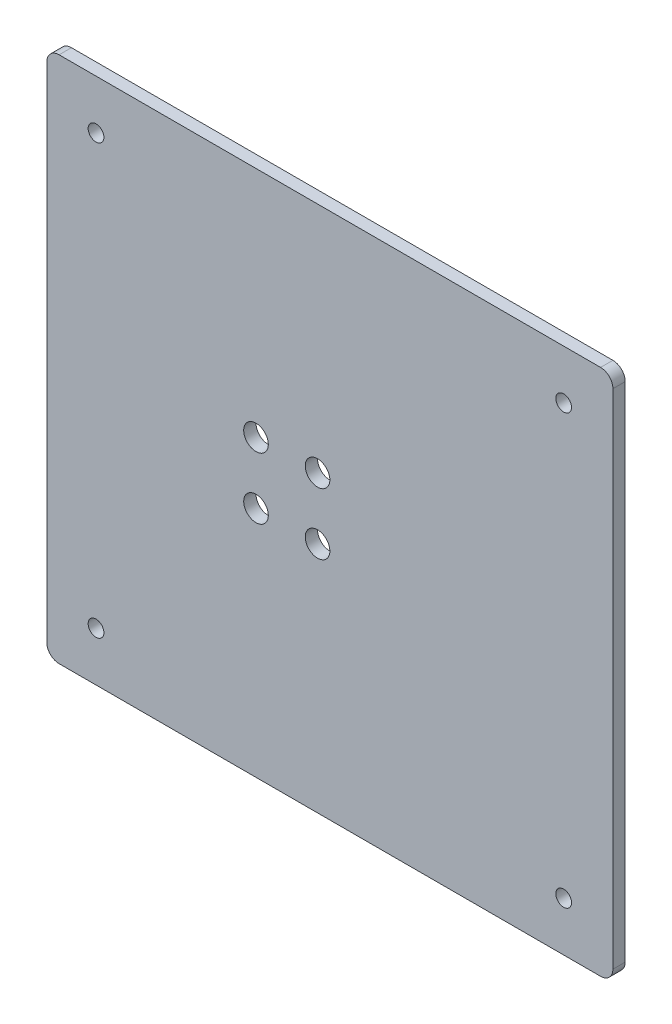
ISO-10303-21;
HEADER;
FILE_DESCRIPTION(('STEP AP214'),'2;1');
FILE_NAME('part.step','',(''),(''),'','','');
FILE_SCHEMA(('AUTOMOTIVE_DESIGN { 1 0 10303 214 1 1 1 1 }'));
ENDSEC;
DATA;
#1=APPLICATION_CONTEXT('core data for automotive mechanical design processes');
#2=APPLICATION_PROTOCOL_DEFINITION('international standard','automotive_design',2000,#1);
#3=PRODUCT_CONTEXT('',#1,'mechanical');
#4=PRODUCT('Part','Part','',(#3));
#5=PRODUCT_RELATED_PRODUCT_CATEGORY('part','',(#4));
#6=PRODUCT_DEFINITION_FORMATION('','',#4);
#7=PRODUCT_DEFINITION_CONTEXT('part definition',#1,'design');
#8=PRODUCT_DEFINITION('design','',#6,#7);
#9=PRODUCT_DEFINITION_SHAPE('','',#8);
#10=(LENGTH_UNIT() NAMED_UNIT(*) SI_UNIT(.MILLI.,.METRE.));
#11=(NAMED_UNIT(*) PLANE_ANGLE_UNIT() SI_UNIT($,.RADIAN.));
#12=(NAMED_UNIT(*) SI_UNIT($,.STERADIAN.) SOLID_ANGLE_UNIT());
#13=UNCERTAINTY_MEASURE_WITH_UNIT(LENGTH_MEASURE(1.E-05),#10,'distance_accuracy_value','');
#14=(GEOMETRIC_REPRESENTATION_CONTEXT(3) GLOBAL_UNCERTAINTY_ASSIGNED_CONTEXT((#13)) GLOBAL_UNIT_ASSIGNED_CONTEXT((#10,
#11,#12)) REPRESENTATION_CONTEXT('',''));
#15=CARTESIAN_POINT('',(0.,0.,0.));
#16=DIRECTION('',(0.,0.,1.));
#17=DIRECTION('',(1.,0.,0.));
#18=AXIS2_PLACEMENT_3D('',#15,#16,#17);
#19=CARTESIAN_POINT('',(0.,0.,0.));
#20=DIRECTION('',(0.,0.,1.));
#21=DIRECTION('',(1.,0.,0.));
#22=AXIS2_PLACEMENT_3D('',#19,#20,#21);
#23=PLANE('',#22);
#24=DIRECTION('',(0.,1.,0.));
#25=VECTOR('',#24,1.);
#26=CARTESIAN_POINT('',(85.,-77.125,0.));
#27=LINE('',#26,#25);
#28=CARTESIAN_POINT('',(85.,-72.125,0.));
#29=VERTEX_POINT('',#28);
#30=CARTESIAN_POINT('',(85.,72.125,0.));
#31=VERTEX_POINT('',#30);
#32=EDGE_CURVE('E327',#29,#31,#27,.T.);
#33=ORIENTED_EDGE('',*,*,#32,.F.);
#34=CARTESIAN_POINT('',(80.,-72.125,0.));
#35=DIRECTION('',(0.,0.,1.));
#36=DIRECTION('',(1.,0.,0.));
#37=AXIS2_PLACEMENT_3D('',#34,#35,#36);
#38=CIRCLE('',#37,5.);
#39=CARTESIAN_POINT('',(80.,-77.125,0.));
#40=VERTEX_POINT('',#39);
#41=EDGE_CURVE('E357',#29,#40,#38,.F.);
#42=ORIENTED_EDGE('',*,*,#41,.T.);
#43=DIRECTION('',(1.,0.,0.));
#44=VECTOR('',#43,1.);
#45=CARTESIAN_POINT('',(85.,-77.125,0.));
#46=LINE('',#45,#44);
#47=CARTESIAN_POINT('',(-80.,-77.125,0.));
#48=VERTEX_POINT('',#47);
#49=EDGE_CURVE('E324',#48,#40,#46,.T.);
#50=ORIENTED_EDGE('',*,*,#49,.F.);
#51=CARTESIAN_POINT('',(-80.,-72.125,0.));
#52=DIRECTION('',(0.,0.,1.));
#53=DIRECTION('',(1.,0.,0.));
#54=AXIS2_PLACEMENT_3D('',#51,#52,#53);
#55=CIRCLE('',#54,5.);
#56=CARTESIAN_POINT('',(-85.,-72.125,0.));
#57=VERTEX_POINT('',#56);
#58=EDGE_CURVE('E355',#48,#57,#55,.F.);
#59=ORIENTED_EDGE('',*,*,#58,.T.);
#60=DIRECTION('',(0.,-1.,0.));
#61=VECTOR('',#60,1.);
#62=CARTESIAN_POINT('',(-85.,-77.125,0.));
#63=LINE('',#62,#61);
#64=CARTESIAN_POINT('',(-85.,72.1249999999999,0.));
#65=VERTEX_POINT('',#64);
#66=EDGE_CURVE('E296',#65,#57,#63,.T.);
#67=ORIENTED_EDGE('',*,*,#66,.F.);
#68=CARTESIAN_POINT('',(-80.,72.125,0.));
#69=DIRECTION('',(0.,0.,1.));
#70=DIRECTION('',(1.,0.,0.));
#71=AXIS2_PLACEMENT_3D('',#68,#69,#70);
#72=CIRCLE('',#71,5.);
#73=CARTESIAN_POINT('',(-80.,77.125,0.));
#74=VERTEX_POINT('',#73);
#75=EDGE_CURVE('E353',#65,#74,#72,.F.);
#76=ORIENTED_EDGE('',*,*,#75,.T.);
#77=DIRECTION('',(-1.,0.,0.));
#78=VECTOR('',#77,1.);
#79=CARTESIAN_POINT('',(85.,77.125,0.));
#80=LINE('',#79,#78);
#81=CARTESIAN_POINT('',(80.,77.125,0.));
#82=VERTEX_POINT('',#81);
#83=EDGE_CURVE('E312',#82,#74,#80,.T.);
#84=ORIENTED_EDGE('',*,*,#83,.F.);
#85=CARTESIAN_POINT('',(80.,72.125,0.));
#86=DIRECTION('',(0.,0.,1.));
#87=DIRECTION('',(1.,0.,0.));
#88=AXIS2_PLACEMENT_3D('',#85,#86,#87);
#89=CIRCLE('',#88,5.);
#90=EDGE_CURVE('E351',#82,#31,#89,.F.);
#91=ORIENTED_EDGE('',*,*,#90,.T.);
#92=EDGE_LOOP('',(#33,#42,#50,#59,#67,#76,#84,#91));
#93=FACE_BOUND('',#92,.T.);
#94=DIRECTION('',(-1.,0.,0.));
#95=VECTOR('',#94,1.);
#96=CARTESIAN_POINT('',(80.,72.125,0.));
#97=LINE('',#96,#95);
#98=CARTESIAN_POINT('',(75.,72.125,0.));
#99=VERTEX_POINT('',#98);
#100=CARTESIAN_POINT('',(-74.9999999999999,72.125,0.));
#101=VERTEX_POINT('',#100);
#102=EDGE_CURVE('E291',#99,#101,#97,.T.);
#103=ORIENTED_EDGE('',*,*,#102,.T.);
#104=CARTESIAN_POINT('',(-74.9999999999999,67.125,0.));
#105=DIRECTION('',(0.,0.,1.));
#106=DIRECTION('',(1.,0.,0.));
#107=AXIS2_PLACEMENT_3D('',#104,#105,#106);
#108=CIRCLE('',#107,5.);
#109=CARTESIAN_POINT('',(-80.,67.1249999999999,0.));
#110=VERTEX_POINT('',#109);
#111=EDGE_CURVE('E386',#101,#110,#108,.T.);
#112=ORIENTED_EDGE('',*,*,#111,.T.);
#113=DIRECTION('',(0.,-1.,0.));
#114=VECTOR('',#113,1.);
#115=CARTESIAN_POINT('',(-80.,-72.125,0.));
#116=LINE('',#115,#114);
#117=CARTESIAN_POINT('',(-80.,-67.125,0.));
#118=VERTEX_POINT('',#117);
#119=EDGE_CURVE('E297',#110,#118,#116,.T.);
#120=ORIENTED_EDGE('',*,*,#119,.T.);
#121=CARTESIAN_POINT('',(-75.,-67.125,0.));
#122=DIRECTION('',(0.,0.,1.));
#123=DIRECTION('',(1.,0.,0.));
#124=AXIS2_PLACEMENT_3D('',#121,#122,#123);
#125=CIRCLE('',#124,5.);
#126=CARTESIAN_POINT('',(-74.9999999999999,-72.125,0.));
#127=VERTEX_POINT('',#126);
#128=EDGE_CURVE('E223',#118,#127,#125,.T.);
#129=ORIENTED_EDGE('',*,*,#128,.T.);
#130=DIRECTION('',(1.,0.,0.));
#131=VECTOR('',#130,1.);
#132=CARTESIAN_POINT('',(80.,-72.125,0.));
#133=LINE('',#132,#131);
#134=CARTESIAN_POINT('',(75.,-72.125,0.));
#135=VERTEX_POINT('',#134);
#136=EDGE_CURVE('E300',#127,#135,#133,.T.);
#137=ORIENTED_EDGE('',*,*,#136,.T.);
#138=CARTESIAN_POINT('',(75.,-67.125,0.));
#139=DIRECTION('',(0.,0.,1.));
#140=DIRECTION('',(1.,0.,0.));
#141=AXIS2_PLACEMENT_3D('',#138,#139,#140);
#142=CIRCLE('',#141,5.);
#143=CARTESIAN_POINT('',(80.,-67.125,0.));
#144=VERTEX_POINT('',#143);
#145=EDGE_CURVE('E204',#135,#144,#142,.T.);
#146=ORIENTED_EDGE('',*,*,#145,.T.);
#147=DIRECTION('',(0.,1.,0.));
#148=VECTOR('',#147,1.);
#149=CARTESIAN_POINT('',(80.,-72.125,0.));
#150=LINE('',#149,#148);
#151=CARTESIAN_POINT('',(80.,67.1249999999999,0.));
#152=VERTEX_POINT('',#151);
#153=EDGE_CURVE('E303',#144,#152,#150,.T.);
#154=ORIENTED_EDGE('',*,*,#153,.T.);
#155=CARTESIAN_POINT('',(75.,67.125,0.));
#156=DIRECTION('',(0.,0.,1.));
#157=DIRECTION('',(1.,0.,0.));
#158=AXIS2_PLACEMENT_3D('',#155,#156,#157);
#159=CIRCLE('',#158,5.);
#160=EDGE_CURVE('E391',#152,#99,#159,.T.);
#161=ORIENTED_EDGE('',*,*,#160,.T.);
#162=EDGE_LOOP('',(#103,#112,#120,#129,#137,#146,#154,#161));
#163=FACE_BOUND('',#162,.T.);
#164=ADVANCED_FACE('F34',(#93,#163),#23,.F.);
#165=CARTESIAN_POINT('',(-85.,-77.125,8.));
#166=DIRECTION('',(1.,0.,0.));
#167=DIRECTION('',(0.,0.,-1.));
#168=AXIS2_PLACEMENT_3D('',#165,#166,#167);
#169=PLANE('',#168);
#170=ORIENTED_EDGE('',*,*,#66,.T.);
#171=DIRECTION('',(0.,0.,-1.));
#172=VECTOR('',#171,1.);
#173=CARTESIAN_POINT('',(-85.,-72.125,8.));
#174=LINE('',#173,#172);
#175=CARTESIAN_POINT('',(-85.,-72.125,8.));
#176=VERTEX_POINT('',#175);
#177=EDGE_CURVE('E379',#57,#176,#174,.F.);
#178=ORIENTED_EDGE('',*,*,#177,.T.);
#179=DIRECTION('',(0.,-1.,0.));
#180=VECTOR('',#179,1.);
#181=CARTESIAN_POINT('',(-85.,-77.125,8.));
#182=LINE('',#181,#180);
#183=CARTESIAN_POINT('',(-85.,72.1249999999999,8.));
#184=VERTEX_POINT('',#183);
#185=EDGE_CURVE('E308',#184,#176,#182,.T.);
#186=ORIENTED_EDGE('',*,*,#185,.F.);
#187=DIRECTION('',(0.,0.,-1.));
#188=VECTOR('',#187,1.);
#189=CARTESIAN_POINT('',(-85.,72.125,8.));
#190=LINE('',#189,#188);
#191=EDGE_CURVE('E376',#184,#65,#190,.T.);
#192=ORIENTED_EDGE('',*,*,#191,.T.);
#193=EDGE_LOOP('',(#170,#178,#186,#192));
#194=FACE_BOUND('',#193,.T.);
#195=ADVANCED_FACE('F427',(#194),#169,.F.);
#196=CARTESIAN_POINT('',(85.,-77.125,8.));
#197=DIRECTION('',(0.,1.,0.));
#198=DIRECTION('',(-1.,0.,0.));
#199=AXIS2_PLACEMENT_3D('',#196,#197,#198);
#200=PLANE('',#199);
#201=ORIENTED_EDGE('',*,*,#49,.T.);
#202=DIRECTION('',(0.,0.,-1.));
#203=VECTOR('',#202,1.);
#204=CARTESIAN_POINT('',(80.,-77.125,8.));
#205=LINE('',#204,#203);
#206=CARTESIAN_POINT('',(80.,-77.125,8.));
#207=VERTEX_POINT('',#206);
#208=EDGE_CURVE('E362',#40,#207,#205,.F.);
#209=ORIENTED_EDGE('',*,*,#208,.T.);
#210=DIRECTION('',(1.,0.,0.));
#211=VECTOR('',#210,1.);
#212=CARTESIAN_POINT('',(85.,-77.125,8.));
#213=LINE('',#212,#211);
#214=CARTESIAN_POINT('',(-80.,-77.125,8.));
#215=VERTEX_POINT('',#214);
#216=EDGE_CURVE('E311',#215,#207,#213,.T.);
#217=ORIENTED_EDGE('',*,*,#216,.F.);
#218=DIRECTION('',(0.,0.,-1.));
#219=VECTOR('',#218,1.);
#220=CARTESIAN_POINT('',(-80.,-77.125,8.));
#221=LINE('',#220,#219);
#222=EDGE_CURVE('E359',#215,#48,#221,.T.);
#223=ORIENTED_EDGE('',*,*,#222,.T.);
#224=EDGE_LOOP('',(#201,#209,#217,#223));
#225=FACE_BOUND('',#224,.T.);
#226=ADVANCED_FACE('F433',(#225),#200,.F.);
#227=CARTESIAN_POINT('',(85.,-77.125,8.));
#228=DIRECTION('',(-1.,0.,0.));
#229=DIRECTION('',(0.,0.,1.));
#230=AXIS2_PLACEMENT_3D('',#227,#228,#229);
#231=PLANE('',#230);
#232=DIRECTION('',(0.,1.,0.));
#233=VECTOR('',#232,1.);
#234=CARTESIAN_POINT('',(85.,-77.125,8.));
#235=LINE('',#234,#233);
#236=CARTESIAN_POINT('',(85.,-72.125,8.));
#237=VERTEX_POINT('',#236);
#238=CARTESIAN_POINT('',(85.,72.125,8.));
#239=VERTEX_POINT('',#238);
#240=EDGE_CURVE('E315',#237,#239,#235,.T.);
#241=ORIENTED_EDGE('',*,*,#240,.F.);
#242=DIRECTION('',(0.,0.,-1.));
#243=VECTOR('',#242,1.);
#244=CARTESIAN_POINT('',(85.,-72.125,8.));
#245=LINE('',#244,#243);
#246=EDGE_CURVE('E348',#237,#29,#245,.T.);
#247=ORIENTED_EDGE('',*,*,#246,.T.);
#248=ORIENTED_EDGE('',*,*,#32,.T.);
#249=DIRECTION('',(0.,0.,-1.));
#250=VECTOR('',#249,1.);
#251=CARTESIAN_POINT('',(85.,72.125,8.));
#252=LINE('',#251,#250);
#253=EDGE_CURVE('E208',#31,#239,#252,.F.);
#254=ORIENTED_EDGE('',*,*,#253,.T.);
#255=EDGE_LOOP('',(#241,#247,#248,#254));
#256=FACE_BOUND('',#255,.T.);
#257=ADVANCED_FACE('F443',(#256),#231,.F.);
#258=CARTESIAN_POINT('',(85.,77.125,8.));
#259=DIRECTION('',(0.,-1.,0.));
#260=DIRECTION('',(0.,0.,-1.));
#261=AXIS2_PLACEMENT_3D('',#258,#259,#260);
#262=PLANE('',#261);
#263=ORIENTED_EDGE('',*,*,#83,.T.);
#264=DIRECTION('',(0.,0.,-1.));
#265=VECTOR('',#264,1.);
#266=CARTESIAN_POINT('',(-80.,77.125,8.));
#267=LINE('',#266,#265);
#268=CARTESIAN_POINT('',(-80.,77.125,8.));
#269=VERTEX_POINT('',#268);
#270=EDGE_CURVE('E384',#74,#269,#267,.F.);
#271=ORIENTED_EDGE('',*,*,#270,.T.);
#272=DIRECTION('',(-1.,0.,0.));
#273=VECTOR('',#272,1.);
#274=CARTESIAN_POINT('',(85.,77.125,8.));
#275=LINE('',#274,#273);
#276=CARTESIAN_POINT('',(80.,77.125,8.));
#277=VERTEX_POINT('',#276);
#278=EDGE_CURVE('E318',#277,#269,#275,.T.);
#279=ORIENTED_EDGE('',*,*,#278,.F.);
#280=DIRECTION('',(0.,0.,-1.));
#281=VECTOR('',#280,1.);
#282=CARTESIAN_POINT('',(80.,77.125,8.));
#283=LINE('',#282,#281);
#284=EDGE_CURVE('E381',#277,#82,#283,.T.);
#285=ORIENTED_EDGE('',*,*,#284,.T.);
#286=EDGE_LOOP('',(#263,#271,#279,#285));
#287=FACE_BOUND('',#286,.T.);
#288=ADVANCED_FACE('F440',(#287),#262,.F.);
#289=CARTESIAN_POINT('',(-80.,-72.125,8.));
#290=DIRECTION('',(1.,0.,0.));
#291=DIRECTION('',(0.,0.,-1.));
#292=AXIS2_PLACEMENT_3D('',#289,#290,#291);
#293=PLANE('',#292);
#294=ORIENTED_EDGE('',*,*,#119,.F.);
#295=DIRECTION('',(0.,0.,-1.));
#296=VECTOR('',#295,1.);
#297=CARTESIAN_POINT('',(-80.,67.125,8.));
#298=LINE('',#297,#296);
#299=CARTESIAN_POINT('',(-80.,67.1249999999999,8.));
#300=VERTEX_POINT('',#299);
#301=EDGE_CURVE('E339',#110,#300,#298,.F.);
#302=ORIENTED_EDGE('',*,*,#301,.T.);
#303=DIRECTION('',(0.,-1.,0.));
#304=VECTOR('',#303,1.);
#305=CARTESIAN_POINT('',(-80.,-72.125,8.));
#306=LINE('',#305,#304);
#307=CARTESIAN_POINT('',(-80.,-67.125,8.));
#308=VERTEX_POINT('',#307);
#309=EDGE_CURVE('E219',#300,#308,#306,.T.);
#310=ORIENTED_EDGE('',*,*,#309,.T.);
#311=DIRECTION('',(0.,0.,-1.));
#312=VECTOR('',#311,1.);
#313=CARTESIAN_POINT('',(-80.,-67.125,0.));
#314=LINE('',#313,#312);
#315=EDGE_CURVE('E336',#308,#118,#314,.T.);
#316=ORIENTED_EDGE('',*,*,#315,.T.);
#317=EDGE_LOOP('',(#294,#302,#310,#316));
#318=FACE_BOUND('',#317,.T.);
#319=ADVANCED_FACE('F410',(#318),#293,.T.);
#320=CARTESIAN_POINT('',(80.,-72.125,8.));
#321=DIRECTION('',(0.,1.,0.));
#322=DIRECTION('',(0.,0.,1.));
#323=AXIS2_PLACEMENT_3D('',#320,#321,#322);
#324=PLANE('',#323);
#325=DIRECTION('',(1.,0.,0.));
#326=VECTOR('',#325,1.);
#327=CARTESIAN_POINT('',(80.,-72.125,8.));
#328=LINE('',#327,#326);
#329=CARTESIAN_POINT('',(-74.9999999999999,-72.125,8.));
#330=VERTEX_POINT('',#329);
#331=CARTESIAN_POINT('',(75.,-72.125,8.));
#332=VERTEX_POINT('',#331);
#333=EDGE_CURVE('E212',#330,#332,#328,.T.);
#334=ORIENTED_EDGE('',*,*,#333,.T.);
#335=DIRECTION('',(0.,0.,-1.));
#336=VECTOR('',#335,1.);
#337=CARTESIAN_POINT('',(75.,-72.125,0.));
#338=LINE('',#337,#336);
#339=EDGE_CURVE('E197',#332,#135,#338,.T.);
#340=ORIENTED_EDGE('',*,*,#339,.T.);
#341=ORIENTED_EDGE('',*,*,#136,.F.);
#342=DIRECTION('',(0.,0.,-1.));
#343=VECTOR('',#342,1.);
#344=CARTESIAN_POINT('',(-75.,-72.125,8.));
#345=LINE('',#344,#343);
#346=EDGE_CURVE('E209',#127,#330,#345,.F.);
#347=ORIENTED_EDGE('',*,*,#346,.T.);
#348=EDGE_LOOP('',(#334,#340,#341,#347));
#349=FACE_BOUND('',#348,.T.);
#350=ADVANCED_FACE('F213',(#349),#324,.T.);
#351=CARTESIAN_POINT('',(80.,-72.125,8.));
#352=DIRECTION('',(-1.,0.,0.));
#353=DIRECTION('',(0.,0.,1.));
#354=AXIS2_PLACEMENT_3D('',#351,#352,#353);
#355=PLANE('',#354);
#356=DIRECTION('',(0.,1.,0.));
#357=VECTOR('',#356,1.);
#358=CARTESIAN_POINT('',(80.,-72.125,8.));
#359=LINE('',#358,#357);
#360=CARTESIAN_POINT('',(80.,-67.125,8.));
#361=VERTEX_POINT('',#360);
#362=CARTESIAN_POINT('',(80.,67.1249999999999,8.));
#363=VERTEX_POINT('',#362);
#364=EDGE_CURVE('E218',#361,#363,#359,.T.);
#365=ORIENTED_EDGE('',*,*,#364,.T.);
#366=DIRECTION('',(0.,0.,-1.));
#367=VECTOR('',#366,1.);
#368=CARTESIAN_POINT('',(80.,67.125,0.));
#369=LINE('',#368,#367);
#370=EDGE_CURVE('E343',#363,#152,#369,.T.);
#371=ORIENTED_EDGE('',*,*,#370,.T.);
#372=ORIENTED_EDGE('',*,*,#153,.F.);
#373=DIRECTION('',(0.,0.,-1.));
#374=VECTOR('',#373,1.);
#375=CARTESIAN_POINT('',(80.,-67.125,8.));
#376=LINE('',#375,#374);
#377=EDGE_CURVE('E341',#144,#361,#376,.F.);
#378=ORIENTED_EDGE('',*,*,#377,.T.);
#379=EDGE_LOOP('',(#365,#371,#372,#378));
#380=FACE_BOUND('',#379,.T.);
#381=ADVANCED_FACE('F400',(#380),#355,.T.);
#382=CARTESIAN_POINT('',(80.,72.125,8.));
#383=DIRECTION('',(0.,-1.,0.));
#384=DIRECTION('',(0.,0.,-1.));
#385=AXIS2_PLACEMENT_3D('',#382,#383,#384);
#386=PLANE('',#385);
#387=DIRECTION('',(-1.,0.,0.));
#388=VECTOR('',#387,1.);
#389=CARTESIAN_POINT('',(80.,72.125,8.));
#390=LINE('',#389,#388);
#391=CARTESIAN_POINT('',(75.,72.125,8.));
#392=VERTEX_POINT('',#391);
#393=CARTESIAN_POINT('',(-74.9999999999999,72.125,8.));
#394=VERTEX_POINT('',#393);
#395=EDGE_CURVE('E294',#392,#394,#390,.T.);
#396=ORIENTED_EDGE('',*,*,#395,.T.);
#397=DIRECTION('',(0.,0.,-1.));
#398=VECTOR('',#397,1.);
#399=CARTESIAN_POINT('',(-74.9999999999999,72.125,0.));
#400=LINE('',#399,#398);
#401=EDGE_CURVE('E333',#394,#101,#400,.T.);
#402=ORIENTED_EDGE('',*,*,#401,.T.);
#403=ORIENTED_EDGE('',*,*,#102,.F.);
#404=DIRECTION('',(0.,0.,-1.));
#405=VECTOR('',#404,1.);
#406=CARTESIAN_POINT('',(75.,72.125,8.));
#407=LINE('',#406,#405);
#408=EDGE_CURVE('E321',#99,#392,#407,.F.);
#409=ORIENTED_EDGE('',*,*,#408,.T.);
#410=EDGE_LOOP('',(#396,#402,#403,#409));
#411=FACE_BOUND('',#410,.T.);
#412=ADVANCED_FACE('F416',(#411),#386,.T.);
#413=CARTESIAN_POINT('',(-74.9999999999999,67.125,8.));
#414=DIRECTION('',(0.,0.,1.));
#415=DIRECTION('',(1.,0.,0.));
#416=AXIS2_PLACEMENT_3D('',#413,#414,#415);
#417=CYLINDRICAL_SURFACE('',#416,5.);
#418=CARTESIAN_POINT('',(-74.9999999999999,67.125,8.));
#419=DIRECTION('',(0.,0.,1.));
#420=DIRECTION('',(1.,0.,0.));
#421=AXIS2_PLACEMENT_3D('',#418,#419,#420);
#422=CIRCLE('',#421,5.);
#423=EDGE_CURVE('E388',#300,#394,#422,.F.);
#424=ORIENTED_EDGE('',*,*,#423,.F.);
#425=ORIENTED_EDGE('',*,*,#301,.F.);
#426=ORIENTED_EDGE('',*,*,#111,.F.);
#427=ORIENTED_EDGE('',*,*,#401,.F.);
#428=EDGE_LOOP('',(#424,#425,#426,#427));
#429=FACE_BOUND('',#428,.T.);
#430=ADVANCED_FACE('F414',(#429),#417,.F.);
#431=CARTESIAN_POINT('',(75.,67.125,8.));
#432=DIRECTION('',(0.,0.,1.));
#433=DIRECTION('',(1.,0.,0.));
#434=AXIS2_PLACEMENT_3D('',#431,#432,#433);
#435=CYLINDRICAL_SURFACE('',#434,5.);
#436=CARTESIAN_POINT('',(75.,67.125,8.));
#437=DIRECTION('',(0.,0.,1.));
#438=DIRECTION('',(1.,0.,0.));
#439=AXIS2_PLACEMENT_3D('',#436,#437,#438);
#440=CIRCLE('',#439,5.);
#441=EDGE_CURVE('E227',#392,#363,#440,.F.);
#442=ORIENTED_EDGE('',*,*,#441,.F.);
#443=ORIENTED_EDGE('',*,*,#408,.F.);
#444=ORIENTED_EDGE('',*,*,#160,.F.);
#445=ORIENTED_EDGE('',*,*,#370,.F.);
#446=EDGE_LOOP('',(#442,#443,#444,#445));
#447=FACE_BOUND('',#446,.T.);
#448=ADVANCED_FACE('F397',(#447),#435,.F.);
#449=CARTESIAN_POINT('',(75.,-67.125,8.));
#450=DIRECTION('',(0.,0.,1.));
#451=DIRECTION('',(1.,0.,0.));
#452=AXIS2_PLACEMENT_3D('',#449,#450,#451);
#453=CYLINDRICAL_SURFACE('',#452,5.);
#454=CARTESIAN_POINT('',(75.,-67.125,8.));
#455=DIRECTION('',(0.,0.,1.));
#456=DIRECTION('',(1.,0.,0.));
#457=AXIS2_PLACEMENT_3D('',#454,#455,#456);
#458=CIRCLE('',#457,5.);
#459=EDGE_CURVE('E202',#361,#332,#458,.F.);
#460=ORIENTED_EDGE('',*,*,#459,.F.);
#461=ORIENTED_EDGE('',*,*,#377,.F.);
#462=ORIENTED_EDGE('',*,*,#145,.F.);
#463=ORIENTED_EDGE('',*,*,#339,.F.);
#464=EDGE_LOOP('',(#460,#461,#462,#463));
#465=FACE_BOUND('',#464,.T.);
#466=ADVANCED_FACE('F199',(#465),#453,.F.);
#467=CARTESIAN_POINT('',(-75.,-67.125,8.));
#468=DIRECTION('',(0.,0.,1.));
#469=DIRECTION('',(1.,0.,0.));
#470=AXIS2_PLACEMENT_3D('',#467,#468,#469);
#471=CYLINDRICAL_SURFACE('',#470,5.);
#472=CARTESIAN_POINT('',(-75.,-67.125,8.));
#473=DIRECTION('',(0.,0.,1.));
#474=DIRECTION('',(1.,0.,0.));
#475=AXIS2_PLACEMENT_3D('',#472,#473,#474);
#476=CIRCLE('',#475,5.);
#477=EDGE_CURVE('E225',#330,#308,#476,.F.);
#478=ORIENTED_EDGE('',*,*,#477,.F.);
#479=ORIENTED_EDGE('',*,*,#346,.F.);
#480=ORIENTED_EDGE('',*,*,#128,.F.);
#481=ORIENTED_EDGE('',*,*,#315,.F.);
#482=EDGE_LOOP('',(#478,#479,#480,#481));
#483=FACE_BOUND('',#482,.T.);
#484=ADVANCED_FACE('F404',(#483),#471,.F.);
#485=CARTESIAN_POINT('',(80.,-72.125,8.));
#486=DIRECTION('',(0.,0.,-1.));
#487=DIRECTION('',(-1.,0.,0.));
#488=AXIS2_PLACEMENT_3D('',#485,#486,#487);
#489=CYLINDRICAL_SURFACE('',#488,5.);
#490=CARTESIAN_POINT('',(80.,-72.125,8.));
#491=DIRECTION('',(0.,0.,1.));
#492=DIRECTION('',(1.,0.,0.));
#493=AXIS2_PLACEMENT_3D('',#490,#491,#492);
#494=CIRCLE('',#493,5.);
#495=EDGE_CURVE('E373',#207,#237,#494,.T.);
#496=ORIENTED_EDGE('',*,*,#495,.F.);
#497=ORIENTED_EDGE('',*,*,#208,.F.);
#498=ORIENTED_EDGE('',*,*,#41,.F.);
#499=ORIENTED_EDGE('',*,*,#246,.F.);
#500=EDGE_LOOP('',(#496,#497,#498,#499));
#501=FACE_BOUND('',#500,.T.);
#502=ADVANCED_FACE('F457',(#501),#489,.T.);
#503=CARTESIAN_POINT('',(-80.,-72.125,8.));
#504=DIRECTION('',(0.,0.,-1.));
#505=DIRECTION('',(-1.,0.,0.));
#506=AXIS2_PLACEMENT_3D('',#503,#504,#505);
#507=CYLINDRICAL_SURFACE('',#506,5.);
#508=CARTESIAN_POINT('',(-80.,-72.125,8.));
#509=DIRECTION('',(0.,0.,1.));
#510=DIRECTION('',(1.,0.,0.));
#511=AXIS2_PLACEMENT_3D('',#508,#509,#510);
#512=CIRCLE('',#511,5.);
#513=EDGE_CURVE('E370',#176,#215,#512,.T.);
#514=ORIENTED_EDGE('',*,*,#513,.F.);
#515=ORIENTED_EDGE('',*,*,#177,.F.);
#516=ORIENTED_EDGE('',*,*,#58,.F.);
#517=ORIENTED_EDGE('',*,*,#222,.F.);
#518=EDGE_LOOP('',(#514,#515,#516,#517));
#519=FACE_BOUND('',#518,.T.);
#520=ADVANCED_FACE('F460',(#519),#507,.T.);
#521=CARTESIAN_POINT('',(-80.,72.125,8.));
#522=DIRECTION('',(0.,0.,-1.));
#523=DIRECTION('',(-1.,0.,0.));
#524=AXIS2_PLACEMENT_3D('',#521,#522,#523);
#525=CYLINDRICAL_SURFACE('',#524,5.);
#526=CARTESIAN_POINT('',(-80.,72.125,8.));
#527=DIRECTION('',(0.,0.,1.));
#528=DIRECTION('',(1.,0.,0.));
#529=AXIS2_PLACEMENT_3D('',#526,#527,#528);
#530=CIRCLE('',#529,5.);
#531=EDGE_CURVE('E367',#269,#184,#530,.T.);
#532=ORIENTED_EDGE('',*,*,#531,.F.);
#533=ORIENTED_EDGE('',*,*,#270,.F.);
#534=ORIENTED_EDGE('',*,*,#75,.F.);
#535=ORIENTED_EDGE('',*,*,#191,.F.);
#536=EDGE_LOOP('',(#532,#533,#534,#535));
#537=FACE_BOUND('',#536,.T.);
#538=ADVANCED_FACE('F464',(#537),#525,.T.);
#539=CARTESIAN_POINT('',(80.,72.125,8.));
#540=DIRECTION('',(0.,0.,-1.));
#541=DIRECTION('',(-1.,0.,0.));
#542=AXIS2_PLACEMENT_3D('',#539,#540,#541);
#543=CYLINDRICAL_SURFACE('',#542,5.);
#544=CARTESIAN_POINT('',(80.,72.125,8.));
#545=DIRECTION('',(0.,0.,1.));
#546=DIRECTION('',(1.,0.,0.));
#547=AXIS2_PLACEMENT_3D('',#544,#545,#546);
#548=CIRCLE('',#547,5.);
#549=EDGE_CURVE('E364',#239,#277,#548,.T.);
#550=ORIENTED_EDGE('',*,*,#549,.F.);
#551=ORIENTED_EDGE('',*,*,#253,.F.);
#552=ORIENTED_EDGE('',*,*,#90,.F.);
#553=ORIENTED_EDGE('',*,*,#284,.F.);
#554=EDGE_LOOP('',(#550,#551,#552,#553));
#555=FACE_BOUND('',#554,.T.);
#556=ADVANCED_FACE('F468',(#555),#543,.T.);
#557=CARTESIAN_POINT('',(0.,0.,8.));
#558=DIRECTION('',(0.,0.,1.));
#559=DIRECTION('',(1.,0.,0.));
#560=AXIS2_PLACEMENT_3D('',#557,#558,#559);
#561=PLANE('',#560);
#562=CARTESIAN_POINT('',(-30.,12.5,8.));
#563=DIRECTION('',(0.,0.,1.));
#564=DIRECTION('',(1.,0.,0.));
#565=AXIS2_PLACEMENT_3D('',#562,#563,#564);
#566=CIRCLE('',#565,5.);
#567=CARTESIAN_POINT('',(-25.,12.5,8.));
#568=VERTEX_POINT('',#567);
#569=EDGE_CURVE('E543',#568,#568,#566,.T.);
#570=ORIENTED_EDGE('',*,*,#569,.T.);
#571=EDGE_LOOP('',(#570));
#572=FACE_BOUND('',#571,.T.);
#573=CARTESIAN_POINT('',(-4.99999999999999,12.5,8.));
#574=DIRECTION('',(0.,0.,1.));
#575=DIRECTION('',(1.,0.,0.));
#576=AXIS2_PLACEMENT_3D('',#573,#574,#575);
#577=CIRCLE('',#576,5.);
#578=CARTESIAN_POINT('',(0.,12.5,8.));
#579=VERTEX_POINT('',#578);
#580=EDGE_CURVE('E38',#579,#579,#577,.T.);
#581=ORIENTED_EDGE('',*,*,#580,.T.);
#582=EDGE_LOOP('',(#581));
#583=FACE_BOUND('',#582,.T.);
#584=CARTESIAN_POINT('',(-4.99999999999999,-12.5,8.));
#585=DIRECTION('',(0.,0.,1.));
#586=DIRECTION('',(1.,0.,0.));
#587=AXIS2_PLACEMENT_3D('',#584,#585,#586);
#588=CIRCLE('',#587,5.);
#589=CARTESIAN_POINT('',(0.,-12.5,8.));
#590=VERTEX_POINT('',#589);
#591=EDGE_CURVE('E534',#590,#590,#588,.T.);
#592=ORIENTED_EDGE('',*,*,#591,.T.);
#593=EDGE_LOOP('',(#592));
#594=FACE_BOUND('',#593,.T.);
#595=CARTESIAN_POINT('',(-30.,-12.5,8.));
#596=DIRECTION('',(0.,0.,1.));
#597=DIRECTION('',(1.,0.,0.));
#598=AXIS2_PLACEMENT_3D('',#595,#596,#597);
#599=CIRCLE('',#598,5.);
#600=CARTESIAN_POINT('',(-25.,-12.5,8.));
#601=VERTEX_POINT('',#600);
#602=EDGE_CURVE('E528',#601,#601,#599,.T.);
#603=ORIENTED_EDGE('',*,*,#602,.T.);
#604=EDGE_LOOP('',(#603));
#605=FACE_BOUND('',#604,.T.);
#606=ORIENTED_EDGE('',*,*,#333,.F.);
#607=ORIENTED_EDGE('',*,*,#477,.T.);
#608=ORIENTED_EDGE('',*,*,#309,.F.);
#609=ORIENTED_EDGE('',*,*,#423,.T.);
#610=ORIENTED_EDGE('',*,*,#395,.F.);
#611=ORIENTED_EDGE('',*,*,#441,.T.);
#612=ORIENTED_EDGE('',*,*,#364,.F.);
#613=ORIENTED_EDGE('',*,*,#459,.T.);
#614=EDGE_LOOP('',(#606,#607,#608,#609,#610,#611,#612,#613));
#615=FACE_BOUND('',#614,.T.);
#616=ADVANCED_FACE('F221',(#572,#583,#594,#605,#615),#561,.F.);
#617=CARTESIAN_POINT('',(-94.9999999999999,87.125,8.));
#618=DIRECTION('',(0.,0.,1.));
#619=DIRECTION('',(1.,0.,0.));
#620=AXIS2_PLACEMENT_3D('',#617,#618,#619);
#621=CIRCLE('',#620,3.19999999999999);
#622=CARTESIAN_POINT('',(-91.8,87.125,8.));
#623=VERTEX_POINT('',#622);
#624=EDGE_CURVE('E522',#623,#623,#621,.T.);
#625=ORIENTED_EDGE('',*,*,#624,.T.);
#626=EDGE_LOOP('',(#625));
#627=FACE_BOUND('',#626,.T.);
#628=CARTESIAN_POINT('',(95.,87.125,8.));
#629=DIRECTION('',(0.,0.,1.));
#630=DIRECTION('',(1.,0.,0.));
#631=AXIS2_PLACEMENT_3D('',#628,#629,#630);
#632=CIRCLE('',#631,3.19999999999999);
#633=CARTESIAN_POINT('',(98.2,87.125,8.));
#634=VERTEX_POINT('',#633);
#635=EDGE_CURVE('E516',#634,#634,#632,.T.);
#636=ORIENTED_EDGE('',*,*,#635,.T.);
#637=EDGE_LOOP('',(#636));
#638=FACE_BOUND('',#637,.T.);
#639=CARTESIAN_POINT('',(95.,-87.125,8.));
#640=DIRECTION('',(0.,0.,1.));
#641=DIRECTION('',(1.,0.,0.));
#642=AXIS2_PLACEMENT_3D('',#639,#640,#641);
#643=CIRCLE('',#642,3.19999999999999);
#644=CARTESIAN_POINT('',(98.2,-87.125,8.));
#645=VERTEX_POINT('',#644);
#646=EDGE_CURVE('E510',#645,#645,#643,.T.);
#647=ORIENTED_EDGE('',*,*,#646,.T.);
#648=EDGE_LOOP('',(#647));
#649=FACE_BOUND('',#648,.T.);
#650=CARTESIAN_POINT('',(-95.,-87.125,8.));
#651=DIRECTION('',(0.,0.,1.));
#652=DIRECTION('',(1.,0.,0.));
#653=AXIS2_PLACEMENT_3D('',#650,#651,#652);
#654=CIRCLE('',#653,3.19999999999999);
#655=CARTESIAN_POINT('',(-91.8,-87.125,8.));
#656=VERTEX_POINT('',#655);
#657=EDGE_CURVE('E284',#656,#656,#654,.T.);
#658=ORIENTED_EDGE('',*,*,#657,.T.);
#659=EDGE_LOOP('',(#658));
#660=FACE_BOUND('',#659,.T.);
#661=DIRECTION('',(0.,-1.,0.));
#662=VECTOR('',#661,1.);
#663=CARTESIAN_POINT('',(-115.,-107.125,8.));
#664=LINE('',#663,#662);
#665=CARTESIAN_POINT('',(-115.,102.125,8.));
#666=VERTEX_POINT('',#665);
#667=CARTESIAN_POINT('',(-115.,-102.125,8.));
#668=VERTEX_POINT('',#667);
#669=EDGE_CURVE('E280',#666,#668,#664,.T.);
#670=ORIENTED_EDGE('',*,*,#669,.F.);
#671=CARTESIAN_POINT('',(-110.,102.125,8.));
#672=DIRECTION('',(0.,0.,1.));
#673=DIRECTION('',(1.,0.,0.));
#674=AXIS2_PLACEMENT_3D('',#671,#672,#673);
#675=CIRCLE('',#674,5.);
#676=CARTESIAN_POINT('',(-110.,107.125,8.));
#677=VERTEX_POINT('',#676);
#678=EDGE_CURVE('E243',#666,#677,#675,.F.);
#679=ORIENTED_EDGE('',*,*,#678,.T.);
#680=DIRECTION('',(-1.,0.,0.));
#681=VECTOR('',#680,1.);
#682=CARTESIAN_POINT('',(115.,107.125,8.));
#683=LINE('',#682,#681);
#684=CARTESIAN_POINT('',(110.,107.125,8.));
#685=VERTEX_POINT('',#684);
#686=EDGE_CURVE('E282',#685,#677,#683,.T.);
#687=ORIENTED_EDGE('',*,*,#686,.F.);
#688=CARTESIAN_POINT('',(110.,102.125,8.));
#689=DIRECTION('',(0.,0.,1.));
#690=DIRECTION('',(1.,0.,0.));
#691=AXIS2_PLACEMENT_3D('',#688,#689,#690);
#692=CIRCLE('',#691,5.);
#693=CARTESIAN_POINT('',(115.,102.125,8.));
#694=VERTEX_POINT('',#693);
#695=EDGE_CURVE('E241',#685,#694,#692,.F.);
#696=ORIENTED_EDGE('',*,*,#695,.T.);
#697=DIRECTION('',(0.,1.,0.));
#698=VECTOR('',#697,1.);
#699=CARTESIAN_POINT('',(115.,-107.125,8.));
#700=LINE('',#699,#698);
#701=CARTESIAN_POINT('',(115.,-102.125,8.));
#702=VERTEX_POINT('',#701);
#703=EDGE_CURVE('E279',#702,#694,#700,.T.);
#704=ORIENTED_EDGE('',*,*,#703,.F.);
#705=CARTESIAN_POINT('',(110.,-102.125,8.));
#706=DIRECTION('',(0.,0.,1.));
#707=DIRECTION('',(1.,0.,0.));
#708=AXIS2_PLACEMENT_3D('',#705,#706,#707);
#709=CIRCLE('',#708,5.);
#710=CARTESIAN_POINT('',(110.,-107.125,8.));
#711=VERTEX_POINT('',#710);
#712=EDGE_CURVE('E239',#702,#711,#709,.F.);
#713=ORIENTED_EDGE('',*,*,#712,.T.);
#714=DIRECTION('',(1.,0.,0.));
#715=VECTOR('',#714,1.);
#716=CARTESIAN_POINT('',(115.,-107.125,8.));
#717=LINE('',#716,#715);
#718=CARTESIAN_POINT('',(-110.,-107.125,8.));
#719=VERTEX_POINT('',#718);
#720=EDGE_CURVE('E268',#719,#711,#717,.T.);
#721=ORIENTED_EDGE('',*,*,#720,.F.);
#722=CARTESIAN_POINT('',(-110.,-102.125,8.));
#723=DIRECTION('',(0.,0.,1.));
#724=DIRECTION('',(1.,0.,0.));
#725=AXIS2_PLACEMENT_3D('',#722,#723,#724);
#726=CIRCLE('',#725,5.);
#727=EDGE_CURVE('E237',#719,#668,#726,.F.);
#728=ORIENTED_EDGE('',*,*,#727,.T.);
#729=EDGE_LOOP('',(#670,#679,#687,#696,#704,#713,#721,#728));
#730=FACE_BOUND('',#729,.T.);
#731=ORIENTED_EDGE('',*,*,#513,.T.);
#732=ORIENTED_EDGE('',*,*,#216,.T.);
#733=ORIENTED_EDGE('',*,*,#495,.T.);
#734=ORIENTED_EDGE('',*,*,#240,.T.);
#735=ORIENTED_EDGE('',*,*,#549,.T.);
#736=ORIENTED_EDGE('',*,*,#278,.T.);
#737=ORIENTED_EDGE('',*,*,#531,.T.);
#738=ORIENTED_EDGE('',*,*,#185,.T.);
#739=EDGE_LOOP('',(#731,#732,#733,#734,#735,#736,#737,#738));
#740=FACE_BOUND('',#739,.T.);
#741=ADVANCED_FACE('F275',(#627,#638,#649,#660,#730,#740),#561,.F.);
#742=CARTESIAN_POINT('',(-115.,-107.125,13.));
#743=DIRECTION('',(1.,0.,0.));
#744=DIRECTION('',(0.,0.,-1.));
#745=AXIS2_PLACEMENT_3D('',#742,#743,#744);
#746=PLANE('',#745);
#747=DIRECTION('',(0.,-1.,0.));
#748=VECTOR('',#747,1.);
#749=CARTESIAN_POINT('',(-115.,-107.125,13.));
#750=LINE('',#749,#748);
#751=CARTESIAN_POINT('',(-115.,102.125,13.));
#752=VERTEX_POINT('',#751);
#753=CARTESIAN_POINT('',(-115.,-102.125,13.));
#754=VERTEX_POINT('',#753);
#755=EDGE_CURVE('E290',#752,#754,#750,.T.);
#756=ORIENTED_EDGE('',*,*,#755,.F.);
#757=DIRECTION('',(0.,0.,-1.));
#758=VECTOR('',#757,1.);
#759=CARTESIAN_POINT('',(-115.,102.125,13.));
#760=LINE('',#759,#758);
#761=EDGE_CURVE('E234',#752,#666,#760,.T.);
#762=ORIENTED_EDGE('',*,*,#761,.T.);
#763=ORIENTED_EDGE('',*,*,#669,.T.);
#764=DIRECTION('',(0.,0.,-1.));
#765=VECTOR('',#764,1.);
#766=CARTESIAN_POINT('',(-115.,-102.125,13.));
#767=LINE('',#766,#765);
#768=EDGE_CURVE('E232',#668,#754,#767,.F.);
#769=ORIENTED_EDGE('',*,*,#768,.T.);
#770=EDGE_LOOP('',(#756,#762,#763,#769));
#771=FACE_BOUND('',#770,.T.);
#772=ADVANCED_FACE('F591',(#771),#746,.F.);
#773=CARTESIAN_POINT('',(115.,-107.125,13.));
#774=DIRECTION('',(0.,1.,0.));
#775=DIRECTION('',(-1.,0.,0.));
#776=AXIS2_PLACEMENT_3D('',#773,#774,#775);
#777=PLANE('',#776);
#778=ORIENTED_EDGE('',*,*,#720,.T.);
#779=DIRECTION('',(0.,0.,-1.));
#780=VECTOR('',#779,1.);
#781=CARTESIAN_POINT('',(110.,-107.125,13.));
#782=LINE('',#781,#780);
#783=CARTESIAN_POINT('',(110.,-107.125,13.));
#784=VERTEX_POINT('',#783);
#785=EDGE_CURVE('E11',#711,#784,#782,.F.);
#786=ORIENTED_EDGE('',*,*,#785,.T.);
#787=DIRECTION('',(1.,0.,0.));
#788=VECTOR('',#787,1.);
#789=CARTESIAN_POINT('',(115.,-107.125,13.));
#790=LINE('',#789,#788);
#791=CARTESIAN_POINT('',(-110.,-107.125,13.));
#792=VERTEX_POINT('',#791);
#793=EDGE_CURVE('E270',#792,#784,#790,.T.);
#794=ORIENTED_EDGE('',*,*,#793,.F.);
#795=DIRECTION('',(0.,0.,-1.));
#796=VECTOR('',#795,1.);
#797=CARTESIAN_POINT('',(-110.,-107.125,13.));
#798=LINE('',#797,#796);
#799=EDGE_CURVE('E43',#792,#719,#798,.T.);
#800=ORIENTED_EDGE('',*,*,#799,.T.);
#801=EDGE_LOOP('',(#778,#786,#794,#800));
#802=FACE_BOUND('',#801,.T.);
#803=ADVANCED_FACE('F267',(#802),#777,.F.);
#804=CARTESIAN_POINT('',(115.,-107.125,13.));
#805=DIRECTION('',(-1.,0.,0.));
#806=DIRECTION('',(0.,-1.,0.));
#807=AXIS2_PLACEMENT_3D('',#804,#805,#806);
#808=PLANE('',#807);
#809=ORIENTED_EDGE('',*,*,#703,.T.);
#810=DIRECTION('',(0.,0.,-1.));
#811=VECTOR('',#810,1.);
#812=CARTESIAN_POINT('',(115.,102.125,13.));
#813=LINE('',#812,#811);
#814=CARTESIAN_POINT('',(115.,102.125,13.));
#815=VERTEX_POINT('',#814);
#816=EDGE_CURVE('E50',#694,#815,#813,.F.);
#817=ORIENTED_EDGE('',*,*,#816,.T.);
#818=DIRECTION('',(0.,1.,0.));
#819=VECTOR('',#818,1.);
#820=CARTESIAN_POINT('',(115.,-107.125,13.));
#821=LINE('',#820,#819);
#822=CARTESIAN_POINT('',(115.,-102.125,13.));
#823=VERTEX_POINT('',#822);
#824=EDGE_CURVE('E490',#823,#815,#821,.T.);
#825=ORIENTED_EDGE('',*,*,#824,.F.);
#826=DIRECTION('',(0.,0.,-1.));
#827=VECTOR('',#826,1.);
#828=CARTESIAN_POINT('',(115.,-102.125,13.));
#829=LINE('',#828,#827);
#830=EDGE_CURVE('E257',#823,#702,#829,.T.);
#831=ORIENTED_EDGE('',*,*,#830,.T.);
#832=EDGE_LOOP('',(#809,#817,#825,#831));
#833=FACE_BOUND('',#832,.T.);
#834=ADVANCED_FACE('F489',(#833),#808,.F.);
#835=CARTESIAN_POINT('',(115.,107.125,13.));
#836=DIRECTION('',(0.,-1.,0.));
#837=DIRECTION('',(1.,0.,0.));
#838=AXIS2_PLACEMENT_3D('',#835,#836,#837);
#839=PLANE('',#838);
#840=ORIENTED_EDGE('',*,*,#686,.T.);
#841=DIRECTION('',(0.,0.,-1.));
#842=VECTOR('',#841,1.);
#843=CARTESIAN_POINT('',(-110.,107.125,13.));
#844=LINE('',#843,#842);
#845=CARTESIAN_POINT('',(-110.,107.125,13.));
#846=VERTEX_POINT('',#845);
#847=EDGE_CURVE('E248',#677,#846,#844,.F.);
#848=ORIENTED_EDGE('',*,*,#847,.T.);
#849=DIRECTION('',(-1.,0.,0.));
#850=VECTOR('',#849,1.);
#851=CARTESIAN_POINT('',(115.,107.125,13.));
#852=LINE('',#851,#850);
#853=CARTESIAN_POINT('',(110.,107.125,13.));
#854=VERTEX_POINT('',#853);
#855=EDGE_CURVE('E301',#854,#846,#852,.T.);
#856=ORIENTED_EDGE('',*,*,#855,.F.);
#857=DIRECTION('',(0.,0.,-1.));
#858=VECTOR('',#857,1.);
#859=CARTESIAN_POINT('',(110.,107.125,13.));
#860=LINE('',#859,#858);
#861=EDGE_CURVE('E245',#854,#685,#860,.T.);
#862=ORIENTED_EDGE('',*,*,#861,.T.);
#863=EDGE_LOOP('',(#840,#848,#856,#862));
#864=FACE_BOUND('',#863,.T.);
#865=ADVANCED_FACE('F496',(#864),#839,.F.);
#866=CARTESIAN_POINT('',(0.,0.,13.));
#867=DIRECTION('',(0.,0.,1.));
#868=DIRECTION('',(1.,0.,0.));
#869=AXIS2_PLACEMENT_3D('',#866,#867,#868);
#870=PLANE('',#869);
#871=CARTESIAN_POINT('',(-30.,12.5,13.));
#872=DIRECTION('',(0.,0.,1.));
#873=DIRECTION('',(1.,0.,0.));
#874=AXIS2_PLACEMENT_3D('',#871,#872,#873);
#875=CIRCLE('',#874,5.);
#876=CARTESIAN_POINT('',(-25.,12.5,13.));
#877=VERTEX_POINT('',#876);
#878=EDGE_CURVE('E546',#877,#877,#875,.T.);
#879=ORIENTED_EDGE('',*,*,#878,.F.);
#880=EDGE_LOOP('',(#879));
#881=FACE_BOUND('',#880,.T.);
#882=CARTESIAN_POINT('',(-4.99999999999999,12.5,13.));
#883=DIRECTION('',(0.,0.,1.));
#884=DIRECTION('',(1.,0.,0.));
#885=AXIS2_PLACEMENT_3D('',#882,#883,#884);
#886=CIRCLE('',#885,5.);
#887=CARTESIAN_POINT('',(0.,12.5,13.));
#888=VERTEX_POINT('',#887);
#889=EDGE_CURVE('E540',#888,#888,#886,.T.);
#890=ORIENTED_EDGE('',*,*,#889,.F.);
#891=EDGE_LOOP('',(#890));
#892=FACE_BOUND('',#891,.T.);
#893=CARTESIAN_POINT('',(-4.99999999999999,-12.5,13.));
#894=DIRECTION('',(0.,0.,1.));
#895=DIRECTION('',(1.,0.,0.));
#896=AXIS2_PLACEMENT_3D('',#893,#894,#895);
#897=CIRCLE('',#896,5.);
#898=CARTESIAN_POINT('',(0.,-12.5,13.));
#899=VERTEX_POINT('',#898);
#900=EDGE_CURVE('E537',#899,#899,#897,.T.);
#901=ORIENTED_EDGE('',*,*,#900,.F.);
#902=EDGE_LOOP('',(#901));
#903=FACE_BOUND('',#902,.T.);
#904=CARTESIAN_POINT('',(-30.,-12.5,13.));
#905=DIRECTION('',(0.,0.,1.));
#906=DIRECTION('',(1.,0.,0.));
#907=AXIS2_PLACEMENT_3D('',#904,#905,#906);
#908=CIRCLE('',#907,5.);
#909=CARTESIAN_POINT('',(-25.,-12.5,13.));
#910=VERTEX_POINT('',#909);
#911=EDGE_CURVE('E531',#910,#910,#908,.T.);
#912=ORIENTED_EDGE('',*,*,#911,.F.);
#913=EDGE_LOOP('',(#912));
#914=FACE_BOUND('',#913,.T.);
#915=CARTESIAN_POINT('',(-94.9999999999999,87.125,13.));
#916=DIRECTION('',(0.,0.,1.));
#917=DIRECTION('',(1.,0.,0.));
#918=AXIS2_PLACEMENT_3D('',#915,#916,#917);
#919=CIRCLE('',#918,3.19999999999999);
#920=CARTESIAN_POINT('',(-91.8,87.125,13.));
#921=VERTEX_POINT('',#920);
#922=EDGE_CURVE('E525',#921,#921,#919,.T.);
#923=ORIENTED_EDGE('',*,*,#922,.F.);
#924=EDGE_LOOP('',(#923));
#925=FACE_BOUND('',#924,.T.);
#926=CARTESIAN_POINT('',(95.,87.125,13.));
#927=DIRECTION('',(0.,0.,1.));
#928=DIRECTION('',(1.,0.,0.));
#929=AXIS2_PLACEMENT_3D('',#926,#927,#928);
#930=CIRCLE('',#929,3.19999999999999);
#931=CARTESIAN_POINT('',(98.2,87.125,13.));
#932=VERTEX_POINT('',#931);
#933=EDGE_CURVE('E519',#932,#932,#930,.T.);
#934=ORIENTED_EDGE('',*,*,#933,.F.);
#935=EDGE_LOOP('',(#934));
#936=FACE_BOUND('',#935,.T.);
#937=CARTESIAN_POINT('',(95.,-87.125,13.));
#938=DIRECTION('',(0.,0.,1.));
#939=DIRECTION('',(1.,0.,0.));
#940=AXIS2_PLACEMENT_3D('',#937,#938,#939);
#941=CIRCLE('',#940,3.19999999999999);
#942=CARTESIAN_POINT('',(98.2,-87.125,13.));
#943=VERTEX_POINT('',#942);
#944=EDGE_CURVE('E513',#943,#943,#941,.T.);
#945=ORIENTED_EDGE('',*,*,#944,.F.);
#946=EDGE_LOOP('',(#945));
#947=FACE_BOUND('',#946,.T.);
#948=CARTESIAN_POINT('',(-95.,-87.125,13.));
#949=DIRECTION('',(0.,0.,1.));
#950=DIRECTION('',(1.,0.,0.));
#951=AXIS2_PLACEMENT_3D('',#948,#949,#950);
#952=CIRCLE('',#951,3.19999999999999);
#953=CARTESIAN_POINT('',(-91.8,-87.125,13.));
#954=VERTEX_POINT('',#953);
#955=EDGE_CURVE('E507',#954,#954,#952,.T.);
#956=ORIENTED_EDGE('',*,*,#955,.F.);
#957=EDGE_LOOP('',(#956));
#958=FACE_BOUND('',#957,.T.);
#959=ORIENTED_EDGE('',*,*,#855,.T.);
#960=CARTESIAN_POINT('',(-110.,102.125,13.));
#961=DIRECTION('',(0.,0.,1.));
#962=DIRECTION('',(1.,0.,0.));
#963=AXIS2_PLACEMENT_3D('',#960,#961,#962);
#964=CIRCLE('',#963,5.);
#965=EDGE_CURVE('E255',#846,#752,#964,.T.);
#966=ORIENTED_EDGE('',*,*,#965,.T.);
#967=ORIENTED_EDGE('',*,*,#755,.T.);
#968=CARTESIAN_POINT('',(-110.,-102.125,13.));
#969=DIRECTION('',(0.,0.,1.));
#970=DIRECTION('',(1.,0.,0.));
#971=AXIS2_PLACEMENT_3D('',#968,#969,#970);
#972=CIRCLE('',#971,5.);
#973=EDGE_CURVE('E250',#754,#792,#972,.T.);
#974=ORIENTED_EDGE('',*,*,#973,.T.);
#975=ORIENTED_EDGE('',*,*,#793,.T.);
#976=CARTESIAN_POINT('',(110.,-102.125,13.));
#977=DIRECTION('',(0.,0.,1.));
#978=DIRECTION('',(1.,0.,0.));
#979=AXIS2_PLACEMENT_3D('',#976,#977,#978);
#980=CIRCLE('',#979,5.);
#981=EDGE_CURVE('E57',#784,#823,#980,.T.);
#982=ORIENTED_EDGE('',*,*,#981,.T.);
#983=ORIENTED_EDGE('',*,*,#824,.T.);
#984=CARTESIAN_POINT('',(110.,102.125,13.));
#985=DIRECTION('',(0.,0.,1.));
#986=DIRECTION('',(1.,0.,0.));
#987=AXIS2_PLACEMENT_3D('',#984,#985,#986);
#988=CIRCLE('',#987,5.);
#989=EDGE_CURVE('E253',#815,#854,#988,.T.);
#990=ORIENTED_EDGE('',*,*,#989,.T.);
#991=EDGE_LOOP('',(#959,#966,#967,#974,#975,#982,#983,#990));
#992=FACE_BOUND('',#991,.T.);
#993=ADVANCED_FACE('F477',(#881,#892,#903,#914,#925,#936,#947,#958,#992),#870,.T.);
#994=CARTESIAN_POINT('',(-110.,102.125,13.));
#995=DIRECTION('',(0.,0.,-1.));
#996=DIRECTION('',(-1.,0.,0.));
#997=AXIS2_PLACEMENT_3D('',#994,#995,#996);
#998=CYLINDRICAL_SURFACE('',#997,5.);
#999=ORIENTED_EDGE('',*,*,#965,.F.);
#1000=ORIENTED_EDGE('',*,*,#847,.F.);
#1001=ORIENTED_EDGE('',*,*,#678,.F.);
#1002=ORIENTED_EDGE('',*,*,#761,.F.);
#1003=EDGE_LOOP('',(#999,#1000,#1001,#1002));
#1004=FACE_BOUND('',#1003,.T.);
#1005=ADVANCED_FACE('F473',(#1004),#998,.T.);
#1006=CARTESIAN_POINT('',(110.,102.125,13.));
#1007=DIRECTION('',(0.,0.,-1.));
#1008=DIRECTION('',(-1.,0.,0.));
#1009=AXIS2_PLACEMENT_3D('',#1006,#1007,#1008);
#1010=CYLINDRICAL_SURFACE('',#1009,5.);
#1011=ORIENTED_EDGE('',*,*,#989,.F.);
#1012=ORIENTED_EDGE('',*,*,#816,.F.);
#1013=ORIENTED_EDGE('',*,*,#695,.F.);
#1014=ORIENTED_EDGE('',*,*,#861,.F.);
#1015=EDGE_LOOP('',(#1011,#1012,#1013,#1014));
#1016=FACE_BOUND('',#1015,.T.);
#1017=ADVANCED_FACE('F476',(#1016),#1010,.T.);
#1018=CARTESIAN_POINT('',(110.,-102.125,13.));
#1019=DIRECTION('',(0.,0.,-1.));
#1020=DIRECTION('',(-1.,0.,0.));
#1021=AXIS2_PLACEMENT_3D('',#1018,#1019,#1020);
#1022=CYLINDRICAL_SURFACE('',#1021,5.);
#1023=ORIENTED_EDGE('',*,*,#981,.F.);
#1024=ORIENTED_EDGE('',*,*,#785,.F.);
#1025=ORIENTED_EDGE('',*,*,#712,.F.);
#1026=ORIENTED_EDGE('',*,*,#830,.F.);
#1027=EDGE_LOOP('',(#1023,#1024,#1025,#1026));
#1028=FACE_BOUND('',#1027,.T.);
#1029=ADVANCED_FACE('F480',(#1028),#1022,.T.);
#1030=CARTESIAN_POINT('',(-110.,-102.125,13.));
#1031=DIRECTION('',(0.,0.,-1.));
#1032=DIRECTION('',(-1.,0.,0.));
#1033=AXIS2_PLACEMENT_3D('',#1030,#1031,#1032);
#1034=CYLINDRICAL_SURFACE('',#1033,5.);
#1035=ORIENTED_EDGE('',*,*,#973,.F.);
#1036=ORIENTED_EDGE('',*,*,#768,.F.);
#1037=ORIENTED_EDGE('',*,*,#727,.F.);
#1038=ORIENTED_EDGE('',*,*,#799,.F.);
#1039=EDGE_LOOP('',(#1035,#1036,#1037,#1038));
#1040=FACE_BOUND('',#1039,.T.);
#1041=ADVANCED_FACE('F36',(#1040),#1034,.T.);
#1042=CARTESIAN_POINT('',(-95.,-87.125,13.));
#1043=DIRECTION('',(0.,0.,1.));
#1044=DIRECTION('',(1.,0.,0.));
#1045=AXIS2_PLACEMENT_3D('',#1042,#1043,#1044);
#1046=CYLINDRICAL_SURFACE('',#1045,3.19999999999999);
#1047=ORIENTED_EDGE('',*,*,#657,.F.);
#1048=EDGE_LOOP('',(#1047));
#1049=FACE_BOUND('',#1048,.T.);
#1050=ORIENTED_EDGE('',*,*,#955,.T.);
#1051=EDGE_LOOP('',(#1050));
#1052=FACE_BOUND('',#1051,.T.);
#1053=ADVANCED_FACE('F487',(#1049,#1052),#1046,.F.);
#1054=CARTESIAN_POINT('',(95.,-87.125,13.));
#1055=DIRECTION('',(0.,0.,1.));
#1056=DIRECTION('',(1.,0.,0.));
#1057=AXIS2_PLACEMENT_3D('',#1054,#1055,#1056);
#1058=CYLINDRICAL_SURFACE('',#1057,3.19999999999999);
#1059=ORIENTED_EDGE('',*,*,#646,.F.);
#1060=EDGE_LOOP('',(#1059));
#1061=FACE_BOUND('',#1060,.T.);
#1062=ORIENTED_EDGE('',*,*,#944,.T.);
#1063=EDGE_LOOP('',(#1062));
#1064=FACE_BOUND('',#1063,.T.);
#1065=ADVANCED_FACE('F571',(#1061,#1064),#1058,.F.);
#1066=CARTESIAN_POINT('',(95.,87.125,13.));
#1067=DIRECTION('',(0.,0.,1.));
#1068=DIRECTION('',(1.,0.,0.));
#1069=AXIS2_PLACEMENT_3D('',#1066,#1067,#1068);
#1070=CYLINDRICAL_SURFACE('',#1069,3.19999999999999);
#1071=ORIENTED_EDGE('',*,*,#635,.F.);
#1072=EDGE_LOOP('',(#1071));
#1073=FACE_BOUND('',#1072,.T.);
#1074=ORIENTED_EDGE('',*,*,#933,.T.);
#1075=EDGE_LOOP('',(#1074));
#1076=FACE_BOUND('',#1075,.T.);
#1077=ADVANCED_FACE('F577',(#1073,#1076),#1070,.F.);
#1078=CARTESIAN_POINT('',(-94.9999999999999,87.125,13.));
#1079=DIRECTION('',(0.,0.,1.));
#1080=DIRECTION('',(1.,0.,0.));
#1081=AXIS2_PLACEMENT_3D('',#1078,#1079,#1080);
#1082=CYLINDRICAL_SURFACE('',#1081,3.19999999999999);
#1083=ORIENTED_EDGE('',*,*,#624,.F.);
#1084=EDGE_LOOP('',(#1083));
#1085=FACE_BOUND('',#1084,.T.);
#1086=ORIENTED_EDGE('',*,*,#922,.T.);
#1087=EDGE_LOOP('',(#1086));
#1088=FACE_BOUND('',#1087,.T.);
#1089=ADVANCED_FACE('F613',(#1085,#1088),#1082,.F.);
#1090=CARTESIAN_POINT('',(-30.,-12.5,13.));
#1091=DIRECTION('',(0.,0.,1.));
#1092=DIRECTION('',(1.,0.,0.));
#1093=AXIS2_PLACEMENT_3D('',#1090,#1091,#1092);
#1094=CYLINDRICAL_SURFACE('',#1093,5.);
#1095=ORIENTED_EDGE('',*,*,#911,.T.);
#1096=EDGE_LOOP('',(#1095));
#1097=FACE_BOUND('',#1096,.T.);
#1098=ORIENTED_EDGE('',*,*,#602,.F.);
#1099=EDGE_LOOP('',(#1098));
#1100=FACE_BOUND('',#1099,.T.);
#1101=ADVANCED_FACE('F617',(#1097,#1100),#1094,.F.);
#1102=CARTESIAN_POINT('',(-4.99999999999999,-12.5,13.));
#1103=DIRECTION('',(0.,0.,1.));
#1104=DIRECTION('',(1.,0.,0.));
#1105=AXIS2_PLACEMENT_3D('',#1102,#1103,#1104);
#1106=CYLINDRICAL_SURFACE('',#1105,5.);
#1107=ORIENTED_EDGE('',*,*,#900,.T.);
#1108=EDGE_LOOP('',(#1107));
#1109=FACE_BOUND('',#1108,.T.);
#1110=ORIENTED_EDGE('',*,*,#591,.F.);
#1111=EDGE_LOOP('',(#1110));
#1112=FACE_BOUND('',#1111,.T.);
#1113=ADVANCED_FACE('F623',(#1109,#1112),#1106,.F.);
#1114=CARTESIAN_POINT('',(-4.99999999999999,12.5,13.));
#1115=DIRECTION('',(0.,0.,1.));
#1116=DIRECTION('',(1.,0.,0.));
#1117=AXIS2_PLACEMENT_3D('',#1114,#1115,#1116);
#1118=CYLINDRICAL_SURFACE('',#1117,5.);
#1119=ORIENTED_EDGE('',*,*,#889,.T.);
#1120=EDGE_LOOP('',(#1119));
#1121=FACE_BOUND('',#1120,.T.);
#1122=ORIENTED_EDGE('',*,*,#580,.F.);
#1123=EDGE_LOOP('',(#1122));
#1124=FACE_BOUND('',#1123,.T.);
#1125=ADVANCED_FACE('F627',(#1121,#1124),#1118,.F.);
#1126=CARTESIAN_POINT('',(-30.,12.5,13.));
#1127=DIRECTION('',(0.,0.,1.));
#1128=DIRECTION('',(1.,0.,0.));
#1129=AXIS2_PLACEMENT_3D('',#1126,#1127,#1128);
#1130=CYLINDRICAL_SURFACE('',#1129,5.);
#1131=ORIENTED_EDGE('',*,*,#878,.T.);
#1132=EDGE_LOOP('',(#1131));
#1133=FACE_BOUND('',#1132,.T.);
#1134=ORIENTED_EDGE('',*,*,#569,.F.);
#1135=EDGE_LOOP('',(#1134));
#1136=FACE_BOUND('',#1135,.T.);
#1137=ADVANCED_FACE('F550',(#1133,#1136),#1130,.F.);
#1138=CLOSED_SHELL('',(#164,#195,#226,#257,#288,#319,#350,#381,#412,#430,#448,#466,#484,#502,
#520,#538,#556,#616,#741,#772,#803,#834,#865,#993,#1005,#1017,#1029,#1041,#1053,#1065,#1077,
#1089,#1101,#1113,#1125,#1137));
#1139=MANIFOLD_SOLID_BREP('B2',#1138);
#1140=ADVANCED_BREP_SHAPE_REPRESENTATION('',(#18,#1139),#14);
#1141=SHAPE_DEFINITION_REPRESENTATION(#9,#1140);
ENDSEC;
END-ISO-10303-21;
